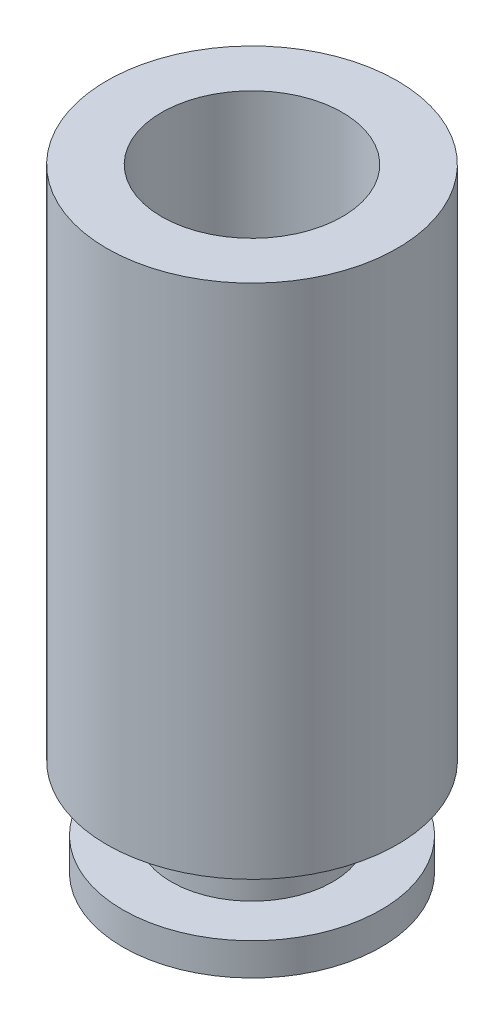
ISO-10303-21;
HEADER;
FILE_DESCRIPTION(('STEP AP214'),'2;1');
FILE_NAME('part.step','',(''),(''),'','','');
FILE_SCHEMA(('AUTOMOTIVE_DESIGN { 1 0 10303 214 1 1 1 1 }'));
ENDSEC;
DATA;
#1=APPLICATION_CONTEXT('core data for automotive mechanical design processes');
#2=APPLICATION_PROTOCOL_DEFINITION('international standard','automotive_design',2000,#1);
#3=PRODUCT_CONTEXT('',#1,'mechanical');
#4=PRODUCT('Part','Part','',(#3));
#5=PRODUCT_RELATED_PRODUCT_CATEGORY('part','',(#4));
#6=PRODUCT_DEFINITION_FORMATION('','',#4);
#7=PRODUCT_DEFINITION_CONTEXT('part definition',#1,'design');
#8=PRODUCT_DEFINITION('design','',#6,#7);
#9=PRODUCT_DEFINITION_SHAPE('','',#8);
#10=(LENGTH_UNIT() NAMED_UNIT(*) SI_UNIT(.MILLI.,.METRE.));
#11=(NAMED_UNIT(*) PLANE_ANGLE_UNIT() SI_UNIT($,.RADIAN.));
#12=(NAMED_UNIT(*) SI_UNIT($,.STERADIAN.) SOLID_ANGLE_UNIT());
#13=UNCERTAINTY_MEASURE_WITH_UNIT(LENGTH_MEASURE(1.E-05),#10,'distance_accuracy_value','');
#14=(GEOMETRIC_REPRESENTATION_CONTEXT(3) GLOBAL_UNCERTAINTY_ASSIGNED_CONTEXT((#13)) GLOBAL_UNIT_ASSIGNED_CONTEXT((#10,
#11,#12)) REPRESENTATION_CONTEXT('',''));
#15=CARTESIAN_POINT('',(0.,0.,0.));
#16=DIRECTION('',(0.,0.,1.));
#17=DIRECTION('',(1.,0.,0.));
#18=AXIS2_PLACEMENT_3D('',#15,#16,#17);
#19=CARTESIAN_POINT('',(-0.522013311509166,8.,-0.51113803418606));
#20=DIRECTION('',(0.,-1.,0.));
#21=DIRECTION('',(0.,0.,-1.));
#22=AXIS2_PLACEMENT_3D('',#19,#20,#21);
#23=CYLINDRICAL_SURFACE('',#22,2.25);
#24=CARTESIAN_POINT('',(-0.522013311509166,8.,-0.51113803418606));
#25=DIRECTION('',(0.,1.,0.));
#26=DIRECTION('',(0.,0.,1.));
#27=AXIS2_PLACEMENT_3D('',#24,#25,#26);
#28=CIRCLE('',#27,2.25);
#29=CARTESIAN_POINT('',(-0.522013311509166,8.,1.73886196581394));
#30=VERTEX_POINT('',#29);
#31=EDGE_CURVE('E53',#30,#30,#28,.T.);
#32=ORIENTED_EDGE('',*,*,#31,.F.);
#33=EDGE_LOOP('',(#32));
#34=FACE_BOUND('',#33,.T.);
#35=CARTESIAN_POINT('',(-0.522013311509166,0.,-0.51113803418606));
#36=DIRECTION('',(0.,1.,0.));
#37=DIRECTION('',(0.,0.,1.));
#38=AXIS2_PLACEMENT_3D('',#35,#36,#37);
#39=CIRCLE('',#38,2.25);
#40=CARTESIAN_POINT('',(-0.522013311509166,0.,1.73886196581394));
#41=VERTEX_POINT('',#40);
#42=EDGE_CURVE('E48',#41,#41,#39,.T.);
#43=ORIENTED_EDGE('',*,*,#42,.T.);
#44=EDGE_LOOP('',(#43));
#45=FACE_BOUND('',#44,.T.);
#46=ADVANCED_FACE('F45',(#34,#45),#23,.T.);
#47=CARTESIAN_POINT('',(-0.522013311509166,8.,-0.51113803418606));
#48=DIRECTION('',(0.,1.,0.));
#49=DIRECTION('',(0.,0.,1.));
#50=AXIS2_PLACEMENT_3D('',#47,#48,#49);
#51=PLANE('',#50);
#52=CARTESIAN_POINT('',(-0.522013311509166,8.,-0.51113803418606));
#53=DIRECTION('',(0.,1.,0.));
#54=DIRECTION('',(0.,0.,1.));
#55=AXIS2_PLACEMENT_3D('',#52,#53,#54);
#56=CIRCLE('',#55,1.4);
#57=CARTESIAN_POINT('',(-0.522013311509166,8.,0.88886196581394));
#58=VERTEX_POINT('',#57);
#59=EDGE_CURVE('E73',#58,#58,#56,.T.);
#60=ORIENTED_EDGE('',*,*,#59,.F.);
#61=EDGE_LOOP('',(#60));
#62=FACE_BOUND('',#61,.T.);
#63=ORIENTED_EDGE('',*,*,#31,.T.);
#64=EDGE_LOOP('',(#63));
#65=FACE_BOUND('',#64,.T.);
#66=ADVANCED_FACE('F90',(#62,#65),#51,.T.);
#67=CARTESIAN_POINT('',(-0.522013311509166,0.,-0.51113803418606));
#68=DIRECTION('',(0.,1.,0.));
#69=DIRECTION('',(0.,0.,1.));
#70=AXIS2_PLACEMENT_3D('',#67,#68,#69);
#71=PLANE('',#70);
#72=CARTESIAN_POINT('',(-0.522013311509166,0.,-0.51113803418606));
#73=DIRECTION('',(0.,-1.,0.));
#74=DIRECTION('',(0.,0.,-1.));
#75=AXIS2_PLACEMENT_3D('',#72,#73,#74);
#76=CIRCLE('',#75,1.25);
#77=CARTESIAN_POINT('',(-0.522013311509166,0.,-1.76113803418606));
#78=VERTEX_POINT('',#77);
#79=EDGE_CURVE('E10',#78,#78,#76,.T.);
#80=ORIENTED_EDGE('',*,*,#79,.F.);
#81=EDGE_LOOP('',(#80));
#82=FACE_BOUND('',#81,.T.);
#83=ORIENTED_EDGE('',*,*,#42,.F.);
#84=EDGE_LOOP('',(#83));
#85=FACE_BOUND('',#84,.T.);
#86=ADVANCED_FACE('F93',(#82,#85),#71,.F.);
#87=CARTESIAN_POINT('',(-0.522013311509166,-1.,-0.51113803418606));
#88=DIRECTION('',(0.,1.,0.));
#89=DIRECTION('',(0.,0.,1.));
#90=AXIS2_PLACEMENT_3D('',#87,#88,#89);
#91=CYLINDRICAL_SURFACE('',#90,1.25);
#92=CARTESIAN_POINT('',(-0.522013311509166,-1.,-0.51113803418606));
#93=DIRECTION('',(0.,-1.,0.));
#94=DIRECTION('',(0.,0.,-1.));
#95=AXIS2_PLACEMENT_3D('',#92,#93,#94);
#96=CIRCLE('',#95,1.25);
#97=CARTESIAN_POINT('',(-0.522013311509166,-1.,-1.76113803418606));
#98=VERTEX_POINT('',#97);
#99=EDGE_CURVE('E60',#98,#98,#96,.T.);
#100=ORIENTED_EDGE('',*,*,#99,.F.);
#101=EDGE_LOOP('',(#100));
#102=FACE_BOUND('',#101,.T.);
#103=ORIENTED_EDGE('',*,*,#79,.T.);
#104=EDGE_LOOP('',(#103));
#105=FACE_BOUND('',#104,.T.);
#106=ADVANCED_FACE('F104',(#102,#105),#91,.T.);
#107=CARTESIAN_POINT('',(-0.522013311509166,-1.5,-0.51113803418606));
#108=DIRECTION('',(0.,1.,0.));
#109=DIRECTION('',(0.,0.,1.));
#110=AXIS2_PLACEMENT_3D('',#107,#108,#109);
#111=CYLINDRICAL_SURFACE('',#110,2.);
#112=CARTESIAN_POINT('',(-0.522013311509166,-1.5,-0.51113803418606));
#113=DIRECTION('',(0.,-1.,0.));
#114=DIRECTION('',(0.,0.,-1.));
#115=AXIS2_PLACEMENT_3D('',#112,#113,#114);
#116=CIRCLE('',#115,2.);
#117=CARTESIAN_POINT('',(-0.522013311509166,-1.5,-2.51113803418606));
#118=VERTEX_POINT('',#117);
#119=EDGE_CURVE('E64',#118,#118,#116,.T.);
#120=ORIENTED_EDGE('',*,*,#119,.F.);
#121=EDGE_LOOP('',(#120));
#122=FACE_BOUND('',#121,.T.);
#123=CARTESIAN_POINT('',(-0.522013311509166,-1.,-0.51113803418606));
#124=DIRECTION('',(0.,-1.,0.));
#125=DIRECTION('',(0.,0.,-1.));
#126=AXIS2_PLACEMENT_3D('',#123,#124,#125);
#127=CIRCLE('',#126,2.);
#128=CARTESIAN_POINT('',(-0.522013311509166,-1.,-2.51113803418606));
#129=VERTEX_POINT('',#128);
#130=EDGE_CURVE('E65',#129,#129,#127,.T.);
#131=ORIENTED_EDGE('',*,*,#130,.T.);
#132=EDGE_LOOP('',(#131));
#133=FACE_BOUND('',#132,.T.);
#134=ADVANCED_FACE('F109',(#122,#133),#111,.T.);
#135=CARTESIAN_POINT('',(-0.522013311509166,-1.5,-0.51113803418606));
#136=DIRECTION('',(0.,-1.,0.));
#137=DIRECTION('',(0.,0.,-1.));
#138=AXIS2_PLACEMENT_3D('',#135,#136,#137);
#139=PLANE('',#138);
#140=ORIENTED_EDGE('',*,*,#119,.T.);
#141=EDGE_LOOP('',(#140));
#142=FACE_BOUND('',#141,.T.);
#143=ADVANCED_FACE('F115',(#142),#139,.T.);
#144=CARTESIAN_POINT('',(-0.522013311509166,-1.,-0.51113803418606));
#145=DIRECTION('',(0.,-1.,0.));
#146=DIRECTION('',(0.,0.,-1.));
#147=AXIS2_PLACEMENT_3D('',#144,#145,#146);
#148=PLANE('',#147);
#149=ORIENTED_EDGE('',*,*,#99,.T.);
#150=EDGE_LOOP('',(#149));
#151=FACE_BOUND('',#150,.T.);
#152=ORIENTED_EDGE('',*,*,#130,.F.);
#153=EDGE_LOOP('',(#152));
#154=FACE_BOUND('',#153,.T.);
#155=ADVANCED_FACE('F86',(#151,#154),#148,.F.);
#156=CARTESIAN_POINT('',(-0.522013311509166,0.5,-0.51113803418606));
#157=DIRECTION('',(0.,1.,0.));
#158=DIRECTION('',(0.,0.,1.));
#159=AXIS2_PLACEMENT_3D('',#156,#157,#158);
#160=CYLINDRICAL_SURFACE('',#159,1.4);
#161=CARTESIAN_POINT('',(-0.522013311509166,0.5,-0.51113803418606));
#162=DIRECTION('',(0.,1.,0.));
#163=DIRECTION('',(0.,0.,1.));
#164=AXIS2_PLACEMENT_3D('',#161,#162,#163);
#165=CIRCLE('',#164,1.4);
#166=CARTESIAN_POINT('',(-0.522013311509166,0.5,0.88886196581394));
#167=VERTEX_POINT('',#166);
#168=EDGE_CURVE('E69',#167,#167,#165,.T.);
#169=ORIENTED_EDGE('',*,*,#168,.F.);
#170=EDGE_LOOP('',(#169));
#171=FACE_BOUND('',#170,.T.);
#172=ORIENTED_EDGE('',*,*,#59,.T.);
#173=EDGE_LOOP('',(#172));
#174=FACE_BOUND('',#173,.T.);
#175=ADVANCED_FACE('F83',(#171,#174),#160,.F.);
#176=CARTESIAN_POINT('',(-0.522013311509166,0.5,-0.51113803418606));
#177=DIRECTION('',(0.,1.,0.));
#178=DIRECTION('',(0.,0.,1.));
#179=AXIS2_PLACEMENT_3D('',#176,#177,#178);
#180=PLANE('',#179);
#181=ORIENTED_EDGE('',*,*,#168,.T.);
#182=EDGE_LOOP('',(#181));
#183=FACE_BOUND('',#182,.T.);
#184=ADVANCED_FACE('F81',(#183),#180,.T.);
#185=CLOSED_SHELL('',(#46,#66,#86,#106,#134,#143,#155,#175,#184));
#186=MANIFOLD_SOLID_BREP('B2',#185);
#187=ADVANCED_BREP_SHAPE_REPRESENTATION('',(#18,#186),#14);
#188=SHAPE_DEFINITION_REPRESENTATION(#9,#187);
ENDSEC;
END-ISO-10303-21;
